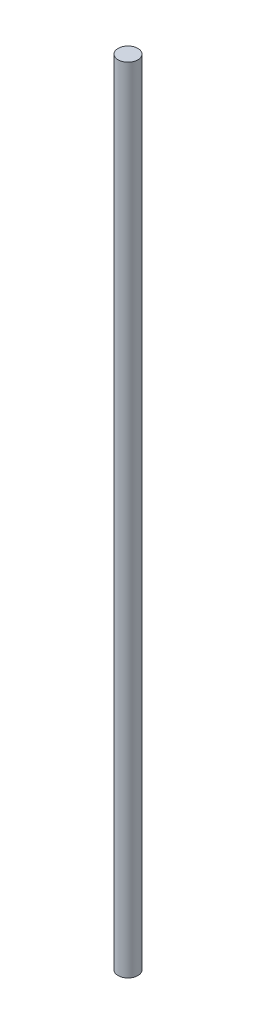
ISO-10303-21;
HEADER;
FILE_DESCRIPTION(('STEP AP214'),'2;1');
FILE_NAME('part.step','',(''),(''),'','','');
FILE_SCHEMA(('AUTOMOTIVE_DESIGN { 1 0 10303 214 1 1 1 1 }'));
ENDSEC;
DATA;
#1=APPLICATION_CONTEXT('core data for automotive mechanical design processes');
#2=APPLICATION_PROTOCOL_DEFINITION('international standard','automotive_design',2000,#1);
#3=PRODUCT_CONTEXT('',#1,'mechanical');
#4=PRODUCT('Part','Part','',(#3));
#5=PRODUCT_RELATED_PRODUCT_CATEGORY('part','',(#4));
#6=PRODUCT_DEFINITION_FORMATION('','',#4);
#7=PRODUCT_DEFINITION_CONTEXT('part definition',#1,'design');
#8=PRODUCT_DEFINITION('design','',#6,#7);
#9=PRODUCT_DEFINITION_SHAPE('','',#8);
#10=(LENGTH_UNIT() NAMED_UNIT(*) SI_UNIT(.MILLI.,.METRE.));
#11=(NAMED_UNIT(*) PLANE_ANGLE_UNIT() SI_UNIT($,.RADIAN.));
#12=(NAMED_UNIT(*) SI_UNIT($,.STERADIAN.) SOLID_ANGLE_UNIT());
#13=UNCERTAINTY_MEASURE_WITH_UNIT(LENGTH_MEASURE(1.E-05),#10,'distance_accuracy_value','');
#14=(GEOMETRIC_REPRESENTATION_CONTEXT(3) GLOBAL_UNCERTAINTY_ASSIGNED_CONTEXT((#13)) GLOBAL_UNIT_ASSIGNED_CONTEXT((#10,
#11,#12)) REPRESENTATION_CONTEXT('',''));
#15=CARTESIAN_POINT('',(0.,0.,0.));
#16=DIRECTION('',(0.,0.,1.));
#17=DIRECTION('',(1.,0.,0.));
#18=AXIS2_PLACEMENT_3D('',#15,#16,#17);
#19=CARTESIAN_POINT('',(0.,400.,0.));
#20=DIRECTION('',(0.,-1.,0.));
#21=DIRECTION('',(0.,0.,-1.));
#22=AXIS2_PLACEMENT_3D('',#19,#20,#21);
#23=CYLINDRICAL_SURFACE('',#22,5.);
#24=CARTESIAN_POINT('',(0.,400.,0.));
#25=DIRECTION('',(0.,1.,0.));
#26=DIRECTION('',(0.,0.,1.));
#27=AXIS2_PLACEMENT_3D('',#24,#25,#26);
#28=CIRCLE('',#27,5.);
#29=CARTESIAN_POINT('',(0.,400.,5.));
#30=VERTEX_POINT('',#29);
#31=EDGE_CURVE('E10',#30,#30,#28,.T.);
#32=ORIENTED_EDGE('',*,*,#31,.F.);
#33=EDGE_LOOP('',(#32));
#34=FACE_BOUND('',#33,.T.);
#35=CARTESIAN_POINT('',(0.,0.,0.));
#36=DIRECTION('',(0.,1.,0.));
#37=DIRECTION('',(0.,0.,1.));
#38=AXIS2_PLACEMENT_3D('',#35,#36,#37);
#39=CIRCLE('',#38,5.);
#40=CARTESIAN_POINT('',(0.,0.,5.));
#41=VERTEX_POINT('',#40);
#42=EDGE_CURVE('E37',#41,#41,#39,.T.);
#43=ORIENTED_EDGE('',*,*,#42,.T.);
#44=EDGE_LOOP('',(#43));
#45=FACE_BOUND('',#44,.T.);
#46=ADVANCED_FACE('F34',(#34,#45),#23,.T.);
#47=CARTESIAN_POINT('',(0.,400.,0.));
#48=DIRECTION('',(0.,1.,0.));
#49=DIRECTION('',(0.,0.,1.));
#50=AXIS2_PLACEMENT_3D('',#47,#48,#49);
#51=PLANE('',#50);
#52=ORIENTED_EDGE('',*,*,#31,.T.);
#53=EDGE_LOOP('',(#52));
#54=FACE_BOUND('',#53,.T.);
#55=ADVANCED_FACE('F49',(#54),#51,.T.);
#56=CARTESIAN_POINT('',(0.,0.,0.));
#57=DIRECTION('',(0.,1.,0.));
#58=DIRECTION('',(0.,0.,1.));
#59=AXIS2_PLACEMENT_3D('',#56,#57,#58);
#60=PLANE('',#59);
#61=ORIENTED_EDGE('',*,*,#42,.F.);
#62=EDGE_LOOP('',(#61));
#63=FACE_BOUND('',#62,.T.);
#64=ADVANCED_FACE('F47',(#63),#60,.F.);
#65=CLOSED_SHELL('',(#46,#55,#64));
#66=MANIFOLD_SOLID_BREP('B2',#65);
#67=ADVANCED_BREP_SHAPE_REPRESENTATION('',(#18,#66),#14);
#68=SHAPE_DEFINITION_REPRESENTATION(#9,#67);
ENDSEC;
END-ISO-10303-21;
